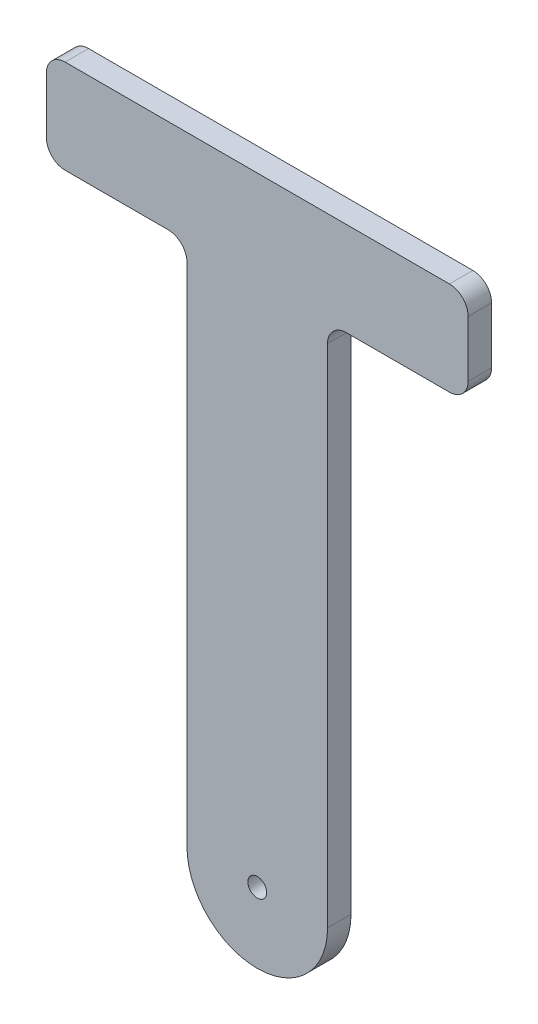
ISO-10303-21;
HEADER;
FILE_DESCRIPTION(('STEP AP214'),'2;1');
FILE_NAME('part.step','',(''),(''),'','','');
FILE_SCHEMA(('AUTOMOTIVE_DESIGN { 1 0 10303 214 1 1 1 1 }'));
ENDSEC;
DATA;
#1=APPLICATION_CONTEXT('core data for automotive mechanical design processes');
#2=APPLICATION_PROTOCOL_DEFINITION('international standard','automotive_design',2000,#1);
#3=PRODUCT_CONTEXT('',#1,'mechanical');
#4=PRODUCT('Part','Part','',(#3));
#5=PRODUCT_RELATED_PRODUCT_CATEGORY('part','',(#4));
#6=PRODUCT_DEFINITION_FORMATION('','',#4);
#7=PRODUCT_DEFINITION_CONTEXT('part definition',#1,'design');
#8=PRODUCT_DEFINITION('design','',#6,#7);
#9=PRODUCT_DEFINITION_SHAPE('','',#8);
#10=(LENGTH_UNIT() NAMED_UNIT(*) SI_UNIT(.MILLI.,.METRE.));
#11=(NAMED_UNIT(*) PLANE_ANGLE_UNIT() SI_UNIT($,.RADIAN.));
#12=(NAMED_UNIT(*) SI_UNIT($,.STERADIAN.) SOLID_ANGLE_UNIT());
#13=UNCERTAINTY_MEASURE_WITH_UNIT(LENGTH_MEASURE(1.E-05),#10,'distance_accuracy_value','');
#14=(GEOMETRIC_REPRESENTATION_CONTEXT(3) GLOBAL_UNCERTAINTY_ASSIGNED_CONTEXT((#13)) GLOBAL_UNIT_ASSIGNED_CONTEXT((#10,
#11,#12)) REPRESENTATION_CONTEXT('',''));
#15=CARTESIAN_POINT('',(0.,0.,0.));
#16=DIRECTION('',(0.,0.,1.));
#17=DIRECTION('',(1.,0.,0.));
#18=AXIS2_PLACEMENT_3D('',#15,#16,#17);
#19=CARTESIAN_POINT('',(-9.82801288749565,0.,3.175));
#20=DIRECTION('',(0.,0.,1.));
#21=DIRECTION('',(1.,0.,0.));
#22=AXIS2_PLACEMENT_3D('',#19,#20,#21);
#23=PLANE('',#22);
#24=CARTESIAN_POINT('',(-9.82801288749565,0.,3.175));
#25=DIRECTION('',(0.,0.,1.));
#26=DIRECTION('',(1.,0.,0.));
#27=AXIS2_PLACEMENT_3D('',#24,#25,#26);
#28=CIRCLE('',#27,9.525);
#29=CARTESIAN_POINT('',(-19.3530128874956,0.,3.175));
#30=VERTEX_POINT('',#29);
#31=CARTESIAN_POINT('',(-0.30301288749565,0.,3.175));
#32=VERTEX_POINT('',#31);
#33=EDGE_CURVE('E193',#30,#32,#28,.T.);
#34=ORIENTED_EDGE('',*,*,#33,.T.);
#35=DIRECTION('',(0.,1.,0.));
#36=VECTOR('',#35,1.);
#37=CARTESIAN_POINT('',(-0.303012887495659,68.58,3.175));
#38=LINE('',#37,#36);
#39=CARTESIAN_POINT('',(-0.30301288749566,68.58,3.175));
#40=VERTEX_POINT('',#39);
#41=EDGE_CURVE('E111',#32,#40,#38,.T.);
#42=ORIENTED_EDGE('',*,*,#41,.T.);
#43=CARTESIAN_POINT('',(2.23698711250434,68.58,3.175));
#44=DIRECTION('',(0.,0.,-1.));
#45=DIRECTION('',(1.,0.,0.));
#46=AXIS2_PLACEMENT_3D('',#43,#44,#45);
#47=CIRCLE('',#46,2.54);
#48=CARTESIAN_POINT('',(2.23698711250436,71.12,3.175));
#49=VERTEX_POINT('',#48);
#50=EDGE_CURVE('E226',#40,#49,#47,.T.);
#51=ORIENTED_EDGE('',*,*,#50,.T.);
#52=DIRECTION('',(1.,0.,0.));
#53=VECTOR('',#52,1.);
#54=CARTESIAN_POINT('',(2.23698711250436,71.12,3.175));
#55=LINE('',#54,#53);
#56=CARTESIAN_POINT('',(16.2069871125043,71.12,3.175));
#57=VERTEX_POINT('',#56);
#58=EDGE_CURVE('E245',#49,#57,#55,.T.);
#59=ORIENTED_EDGE('',*,*,#58,.T.);
#60=CARTESIAN_POINT('',(16.2069871125043,73.66,3.175));
#61=DIRECTION('',(0.,0.,1.));
#62=DIRECTION('',(1.,0.,0.));
#63=AXIS2_PLACEMENT_3D('',#60,#61,#62);
#64=CIRCLE('',#63,2.54);
#65=CARTESIAN_POINT('',(18.7469871125043,73.66,3.175));
#66=VERTEX_POINT('',#65);
#67=EDGE_CURVE('E242',#57,#66,#64,.T.);
#68=ORIENTED_EDGE('',*,*,#67,.T.);
#69=DIRECTION('',(0.,1.,0.));
#70=VECTOR('',#69,1.);
#71=CARTESIAN_POINT('',(18.7469871125043,73.66,3.175));
#72=LINE('',#71,#70);
#73=CARTESIAN_POINT('',(18.7469871125043,81.28,3.175));
#74=VERTEX_POINT('',#73);
#75=EDGE_CURVE('E244',#66,#74,#72,.T.);
#76=ORIENTED_EDGE('',*,*,#75,.T.);
#77=CARTESIAN_POINT('',(16.2069871125043,81.28,3.175));
#78=DIRECTION('',(0.,0.,1.));
#79=DIRECTION('',(1.,0.,0.));
#80=AXIS2_PLACEMENT_3D('',#77,#78,#79);
#81=CIRCLE('',#80,2.54);
#82=CARTESIAN_POINT('',(16.2069871125043,83.82,3.175));
#83=VERTEX_POINT('',#82);
#84=EDGE_CURVE('E247',#74,#83,#81,.T.);
#85=ORIENTED_EDGE('',*,*,#84,.T.);
#86=DIRECTION('',(-1.,0.,0.));
#87=VECTOR('',#86,1.);
#88=CARTESIAN_POINT('',(16.2069871125043,83.82,3.175));
#89=LINE('',#88,#87);
#90=CARTESIAN_POINT('',(-35.8630128874956,83.82,3.175));
#91=VERTEX_POINT('',#90);
#92=EDGE_CURVE('E253',#83,#91,#89,.T.);
#93=ORIENTED_EDGE('',*,*,#92,.T.);
#94=CARTESIAN_POINT('',(-35.8630128874956,81.28,3.175));
#95=DIRECTION('',(0.,0.,1.));
#96=DIRECTION('',(-1.,0.,0.));
#97=AXIS2_PLACEMENT_3D('',#94,#95,#96);
#98=CIRCLE('',#97,2.54);
#99=CARTESIAN_POINT('',(-38.4030128874957,81.28,3.175));
#100=VERTEX_POINT('',#99);
#101=EDGE_CURVE('E255',#91,#100,#98,.T.);
#102=ORIENTED_EDGE('',*,*,#101,.T.);
#103=DIRECTION('',(0.,-1.,0.));
#104=VECTOR('',#103,1.);
#105=CARTESIAN_POINT('',(-38.4030128874957,73.66,3.175));
#106=LINE('',#105,#104);
#107=CARTESIAN_POINT('',(-38.4030128874957,73.66,3.175));
#108=VERTEX_POINT('',#107);
#109=EDGE_CURVE('E257',#100,#108,#106,.T.);
#110=ORIENTED_EDGE('',*,*,#109,.T.);
#111=CARTESIAN_POINT('',(-35.8630128874957,73.66,3.175));
#112=DIRECTION('',(0.,0.,1.));
#113=DIRECTION('',(-1.,0.,0.));
#114=AXIS2_PLACEMENT_3D('',#111,#112,#113);
#115=CIRCLE('',#114,2.54);
#116=CARTESIAN_POINT('',(-35.8630128874956,71.12,3.175));
#117=VERTEX_POINT('',#116);
#118=EDGE_CURVE('E148',#108,#117,#115,.T.);
#119=ORIENTED_EDGE('',*,*,#118,.T.);
#120=DIRECTION('',(1.,0.,0.));
#121=VECTOR('',#120,1.);
#122=CARTESIAN_POINT('',(-21.8930128874957,71.12,3.175));
#123=LINE('',#122,#121);
#124=CARTESIAN_POINT('',(-21.8930128874957,71.12,3.175));
#125=VERTEX_POINT('',#124);
#126=EDGE_CURVE('E142',#117,#125,#123,.T.);
#127=ORIENTED_EDGE('',*,*,#126,.T.);
#128=CARTESIAN_POINT('',(-21.8930128874957,68.58,3.175));
#129=DIRECTION('',(0.,0.,-1.));
#130=DIRECTION('',(1.,0.,0.));
#131=AXIS2_PLACEMENT_3D('',#128,#129,#130);
#132=CIRCLE('',#131,2.54);
#133=CARTESIAN_POINT('',(-19.3530128874957,68.58,3.175));
#134=VERTEX_POINT('',#133);
#135=EDGE_CURVE('E146',#125,#134,#132,.T.);
#136=ORIENTED_EDGE('',*,*,#135,.T.);
#137=DIRECTION('',(0.,-1.,0.));
#138=VECTOR('',#137,1.);
#139=CARTESIAN_POINT('',(-19.3530128874956,0.,3.175));
#140=LINE('',#139,#138);
#141=EDGE_CURVE('E50',#134,#30,#140,.T.);
#142=ORIENTED_EDGE('',*,*,#141,.T.);
#143=EDGE_LOOP('',(#34,#42,#51,#59,#68,#76,#85,#93,#102,#110,#119,#127,#136,#142));
#144=FACE_BOUND('',#143,.T.);
#145=CARTESIAN_POINT('',(-9.82801288749565,0.,3.175));
#146=DIRECTION('',(0.,0.,1.));
#147=DIRECTION('',(1.,0.,0.));
#148=AXIS2_PLACEMENT_3D('',#145,#146,#147);
#149=CIRCLE('',#148,1.27);
#150=CARTESIAN_POINT('',(-8.55801288749565,0.,3.175));
#151=VERTEX_POINT('',#150);
#152=EDGE_CURVE('E170',#151,#151,#149,.T.);
#153=ORIENTED_EDGE('',*,*,#152,.F.);
#154=EDGE_LOOP('',(#153));
#155=FACE_BOUND('',#154,.T.);
#156=ADVANCED_FACE('F33',(#144,#155),#23,.T.);
#157=CARTESIAN_POINT('',(-9.82801288749565,0.,0.));
#158=DIRECTION('',(0.,0.,1.));
#159=DIRECTION('',(1.,0.,0.));
#160=AXIS2_PLACEMENT_3D('',#157,#158,#159);
#161=PLANE('',#160);
#162=CARTESIAN_POINT('',(-9.82801288749565,0.,0.));
#163=DIRECTION('',(0.,0.,1.));
#164=DIRECTION('',(1.,0.,0.));
#165=AXIS2_PLACEMENT_3D('',#162,#163,#164);
#166=CIRCLE('',#165,9.525);
#167=CARTESIAN_POINT('',(-19.3530128874956,0.,0.));
#168=VERTEX_POINT('',#167);
#169=CARTESIAN_POINT('',(-0.30301288749565,0.,0.));
#170=VERTEX_POINT('',#169);
#171=EDGE_CURVE('E166',#168,#170,#166,.T.);
#172=ORIENTED_EDGE('',*,*,#171,.F.);
#173=DIRECTION('',(0.,-1.,0.));
#174=VECTOR('',#173,1.);
#175=CARTESIAN_POINT('',(-19.3530128874956,0.,0.));
#176=LINE('',#175,#174);
#177=CARTESIAN_POINT('',(-19.3530128874957,68.58,0.));
#178=VERTEX_POINT('',#177);
#179=EDGE_CURVE('E103',#178,#168,#176,.T.);
#180=ORIENTED_EDGE('',*,*,#179,.F.);
#181=CARTESIAN_POINT('',(-21.8930128874957,68.58,0.));
#182=DIRECTION('',(0.,0.,-1.));
#183=DIRECTION('',(1.,0.,0.));
#184=AXIS2_PLACEMENT_3D('',#181,#182,#183);
#185=CIRCLE('',#184,2.54);
#186=CARTESIAN_POINT('',(-21.8930128874957,71.12,0.));
#187=VERTEX_POINT('',#186);
#188=EDGE_CURVE('E97',#187,#178,#185,.T.);
#189=ORIENTED_EDGE('',*,*,#188,.F.);
#190=DIRECTION('',(1.,0.,0.));
#191=VECTOR('',#190,1.);
#192=CARTESIAN_POINT('',(-21.8930128874957,71.12,0.));
#193=LINE('',#192,#191);
#194=CARTESIAN_POINT('',(-35.8630128874956,71.12,0.));
#195=VERTEX_POINT('',#194);
#196=EDGE_CURVE('E156',#195,#187,#193,.T.);
#197=ORIENTED_EDGE('',*,*,#196,.F.);
#198=CARTESIAN_POINT('',(-35.8630128874957,73.66,0.));
#199=DIRECTION('',(0.,0.,1.));
#200=DIRECTION('',(-1.,0.,0.));
#201=AXIS2_PLACEMENT_3D('',#198,#199,#200);
#202=CIRCLE('',#201,2.54);
#203=CARTESIAN_POINT('',(-38.4030128874957,73.66,0.));
#204=VERTEX_POINT('',#203);
#205=EDGE_CURVE('E188',#204,#195,#202,.T.);
#206=ORIENTED_EDGE('',*,*,#205,.F.);
#207=DIRECTION('',(0.,-1.,0.));
#208=VECTOR('',#207,1.);
#209=CARTESIAN_POINT('',(-38.4030128874957,73.66,0.));
#210=LINE('',#209,#208);
#211=CARTESIAN_POINT('',(-38.4030128874957,81.28,0.));
#212=VERTEX_POINT('',#211);
#213=EDGE_CURVE('E186',#212,#204,#210,.T.);
#214=ORIENTED_EDGE('',*,*,#213,.F.);
#215=CARTESIAN_POINT('',(-35.8630128874956,81.28,0.));
#216=DIRECTION('',(0.,0.,1.));
#217=DIRECTION('',(-1.,0.,0.));
#218=AXIS2_PLACEMENT_3D('',#215,#216,#217);
#219=CIRCLE('',#218,2.54);
#220=CARTESIAN_POINT('',(-35.8630128874956,83.82,0.));
#221=VERTEX_POINT('',#220);
#222=EDGE_CURVE('E184',#221,#212,#219,.T.);
#223=ORIENTED_EDGE('',*,*,#222,.F.);
#224=DIRECTION('',(-1.,0.,0.));
#225=VECTOR('',#224,1.);
#226=CARTESIAN_POINT('',(16.2069871125043,83.82,0.));
#227=LINE('',#226,#225);
#228=CARTESIAN_POINT('',(16.2069871125043,83.82,0.));
#229=VERTEX_POINT('',#228);
#230=EDGE_CURVE('E182',#229,#221,#227,.T.);
#231=ORIENTED_EDGE('',*,*,#230,.F.);
#232=CARTESIAN_POINT('',(16.2069871125043,81.28,0.));
#233=DIRECTION('',(0.,0.,1.));
#234=DIRECTION('',(1.,0.,0.));
#235=AXIS2_PLACEMENT_3D('',#232,#233,#234);
#236=CIRCLE('',#235,2.54);
#237=CARTESIAN_POINT('',(18.7469871125043,81.28,0.));
#238=VERTEX_POINT('',#237);
#239=EDGE_CURVE('E180',#238,#229,#236,.T.);
#240=ORIENTED_EDGE('',*,*,#239,.F.);
#241=DIRECTION('',(0.,1.,0.));
#242=VECTOR('',#241,1.);
#243=CARTESIAN_POINT('',(18.7469871125043,73.66,0.));
#244=LINE('',#243,#242);
#245=CARTESIAN_POINT('',(18.7469871125043,73.66,0.));
#246=VERTEX_POINT('',#245);
#247=EDGE_CURVE('E178',#246,#238,#244,.T.);
#248=ORIENTED_EDGE('',*,*,#247,.F.);
#249=CARTESIAN_POINT('',(16.2069871125043,73.66,0.));
#250=DIRECTION('',(0.,0.,1.));
#251=DIRECTION('',(1.,0.,0.));
#252=AXIS2_PLACEMENT_3D('',#249,#250,#251);
#253=CIRCLE('',#252,2.54);
#254=CARTESIAN_POINT('',(16.2069871125043,71.12,0.));
#255=VERTEX_POINT('',#254);
#256=EDGE_CURVE('E176',#255,#246,#253,.T.);
#257=ORIENTED_EDGE('',*,*,#256,.F.);
#258=DIRECTION('',(1.,0.,0.));
#259=VECTOR('',#258,1.);
#260=CARTESIAN_POINT('',(2.23698711250436,71.12,0.));
#261=LINE('',#260,#259);
#262=CARTESIAN_POINT('',(2.23698711250436,71.12,0.));
#263=VERTEX_POINT('',#262);
#264=EDGE_CURVE('E174',#263,#255,#261,.T.);
#265=ORIENTED_EDGE('',*,*,#264,.F.);
#266=CARTESIAN_POINT('',(2.23698711250434,68.58,0.));
#267=DIRECTION('',(0.,0.,-1.));
#268=DIRECTION('',(1.,0.,0.));
#269=AXIS2_PLACEMENT_3D('',#266,#267,#268);
#270=CIRCLE('',#269,2.54);
#271=CARTESIAN_POINT('',(-0.30301288749566,68.58,0.));
#272=VERTEX_POINT('',#271);
#273=EDGE_CURVE('E172',#272,#263,#270,.T.);
#274=ORIENTED_EDGE('',*,*,#273,.F.);
#275=DIRECTION('',(0.,1.,0.));
#276=VECTOR('',#275,1.);
#277=CARTESIAN_POINT('',(-0.303012887495659,68.58,0.));
#278=LINE('',#277,#276);
#279=EDGE_CURVE('E169',#170,#272,#278,.T.);
#280=ORIENTED_EDGE('',*,*,#279,.F.);
#281=EDGE_LOOP('',(#172,#180,#189,#197,#206,#214,#223,#231,#240,#248,#257,#265,#274,#280));
#282=FACE_BOUND('',#281,.T.);
#283=CARTESIAN_POINT('',(-9.82801288749565,0.,0.));
#284=DIRECTION('',(0.,0.,1.));
#285=DIRECTION('',(1.,0.,0.));
#286=AXIS2_PLACEMENT_3D('',#283,#284,#285);
#287=CIRCLE('',#286,1.27);
#288=CARTESIAN_POINT('',(-8.55801288749565,0.,0.));
#289=VERTEX_POINT('',#288);
#290=EDGE_CURVE('E430',#289,#289,#287,.T.);
#291=ORIENTED_EDGE('',*,*,#290,.T.);
#292=EDGE_LOOP('',(#291));
#293=FACE_BOUND('',#292,.T.);
#294=ADVANCED_FACE('F230',(#282,#293),#161,.F.);
#295=CARTESIAN_POINT('',(-9.82801288749565,0.,3.175));
#296=DIRECTION('',(0.,0.,-1.));
#297=DIRECTION('',(-1.,0.,0.));
#298=AXIS2_PLACEMENT_3D('',#295,#296,#297);
#299=CYLINDRICAL_SURFACE('',#298,9.525);
#300=ORIENTED_EDGE('',*,*,#171,.T.);
#301=DIRECTION('',(0.,0.,-1.));
#302=VECTOR('',#301,1.);
#303=CARTESIAN_POINT('',(-0.30301288749565,0.,3.175));
#304=LINE('',#303,#302);
#305=EDGE_CURVE('E11',#32,#170,#304,.T.);
#306=ORIENTED_EDGE('',*,*,#305,.F.);
#307=ORIENTED_EDGE('',*,*,#33,.F.);
#308=DIRECTION('',(0.,0.,-1.));
#309=VECTOR('',#308,1.);
#310=CARTESIAN_POINT('',(-19.3530128874956,0.,3.175));
#311=LINE('',#310,#309);
#312=EDGE_CURVE('E162',#30,#168,#311,.T.);
#313=ORIENTED_EDGE('',*,*,#312,.T.);
#314=EDGE_LOOP('',(#300,#306,#307,#313));
#315=FACE_BOUND('',#314,.T.);
#316=ADVANCED_FACE('F35',(#315),#299,.T.);
#317=CARTESIAN_POINT('',(-0.303012887495659,68.58,3.175));
#318=DIRECTION('',(-1.,0.,0.));
#319=DIRECTION('',(0.,-1.,0.));
#320=AXIS2_PLACEMENT_3D('',#317,#318,#319);
#321=PLANE('',#320);
#322=ORIENTED_EDGE('',*,*,#279,.T.);
#323=DIRECTION('',(0.,0.,-1.));
#324=VECTOR('',#323,1.);
#325=CARTESIAN_POINT('',(-0.30301288749566,68.58,3.175));
#326=LINE('',#325,#324);
#327=EDGE_CURVE('E42',#40,#272,#326,.T.);
#328=ORIENTED_EDGE('',*,*,#327,.F.);
#329=ORIENTED_EDGE('',*,*,#41,.F.);
#330=ORIENTED_EDGE('',*,*,#305,.T.);
#331=EDGE_LOOP('',(#322,#328,#329,#330));
#332=FACE_BOUND('',#331,.T.);
#333=ADVANCED_FACE('F291',(#332),#321,.F.);
#334=CARTESIAN_POINT('',(2.23698711250434,68.58,3.175));
#335=DIRECTION('',(0.,0.,-1.));
#336=DIRECTION('',(-1.,0.,0.));
#337=AXIS2_PLACEMENT_3D('',#334,#335,#336);
#338=CYLINDRICAL_SURFACE('',#337,2.54);
#339=ORIENTED_EDGE('',*,*,#273,.T.);
#340=DIRECTION('',(0.,0.,-1.));
#341=VECTOR('',#340,1.);
#342=CARTESIAN_POINT('',(2.23698711250436,71.12,3.175));
#343=LINE('',#342,#341);
#344=EDGE_CURVE('E218',#49,#263,#343,.T.);
#345=ORIENTED_EDGE('',*,*,#344,.F.);
#346=ORIENTED_EDGE('',*,*,#50,.F.);
#347=ORIENTED_EDGE('',*,*,#327,.T.);
#348=EDGE_LOOP('',(#339,#345,#346,#347));
#349=FACE_BOUND('',#348,.T.);
#350=ADVANCED_FACE('F224',(#349),#338,.F.);
#351=CARTESIAN_POINT('',(2.23698711250436,71.12,3.175));
#352=DIRECTION('',(0.,1.,0.));
#353=DIRECTION('',(0.,0.,1.));
#354=AXIS2_PLACEMENT_3D('',#351,#352,#353);
#355=PLANE('',#354);
#356=ORIENTED_EDGE('',*,*,#264,.T.);
#357=DIRECTION('',(0.,0.,-1.));
#358=VECTOR('',#357,1.);
#359=CARTESIAN_POINT('',(16.2069871125043,71.12,3.175));
#360=LINE('',#359,#358);
#361=EDGE_CURVE('E215',#57,#255,#360,.T.);
#362=ORIENTED_EDGE('',*,*,#361,.F.);
#363=ORIENTED_EDGE('',*,*,#58,.F.);
#364=ORIENTED_EDGE('',*,*,#344,.T.);
#365=EDGE_LOOP('',(#356,#362,#363,#364));
#366=FACE_BOUND('',#365,.T.);
#367=ADVANCED_FACE('F236',(#366),#355,.F.);
#368=CARTESIAN_POINT('',(16.2069871125043,73.66,3.175));
#369=DIRECTION('',(0.,0.,-1.));
#370=DIRECTION('',(-1.,0.,0.));
#371=AXIS2_PLACEMENT_3D('',#368,#369,#370);
#372=CYLINDRICAL_SURFACE('',#371,2.54);
#373=ORIENTED_EDGE('',*,*,#256,.T.);
#374=DIRECTION('',(0.,0.,-1.));
#375=VECTOR('',#374,1.);
#376=CARTESIAN_POINT('',(18.7469871125043,73.66,3.175));
#377=LINE('',#376,#375);
#378=EDGE_CURVE('E212',#66,#246,#377,.T.);
#379=ORIENTED_EDGE('',*,*,#378,.F.);
#380=ORIENTED_EDGE('',*,*,#67,.F.);
#381=ORIENTED_EDGE('',*,*,#361,.T.);
#382=EDGE_LOOP('',(#373,#379,#380,#381));
#383=FACE_BOUND('',#382,.T.);
#384=ADVANCED_FACE('F240',(#383),#372,.T.);
#385=CARTESIAN_POINT('',(18.7469871125043,73.66,3.175));
#386=DIRECTION('',(-1.,0.,0.));
#387=DIRECTION('',(0.,0.,1.));
#388=AXIS2_PLACEMENT_3D('',#385,#386,#387);
#389=PLANE('',#388);
#390=ORIENTED_EDGE('',*,*,#247,.T.);
#391=DIRECTION('',(0.,0.,-1.));
#392=VECTOR('',#391,1.);
#393=CARTESIAN_POINT('',(18.7469871125043,81.28,3.175));
#394=LINE('',#393,#392);
#395=EDGE_CURVE('E209',#74,#238,#394,.T.);
#396=ORIENTED_EDGE('',*,*,#395,.F.);
#397=ORIENTED_EDGE('',*,*,#75,.F.);
#398=ORIENTED_EDGE('',*,*,#378,.T.);
#399=EDGE_LOOP('',(#390,#396,#397,#398));
#400=FACE_BOUND('',#399,.T.);
#401=ADVANCED_FACE('F304',(#400),#389,.F.);
#402=CARTESIAN_POINT('',(16.2069871125043,81.28,3.175));
#403=DIRECTION('',(0.,0.,-1.));
#404=DIRECTION('',(-1.,0.,0.));
#405=AXIS2_PLACEMENT_3D('',#402,#403,#404);
#406=CYLINDRICAL_SURFACE('',#405,2.54);
#407=ORIENTED_EDGE('',*,*,#239,.T.);
#408=DIRECTION('',(0.,0.,-1.));
#409=VECTOR('',#408,1.);
#410=CARTESIAN_POINT('',(16.2069871125043,83.82,3.175));
#411=LINE('',#410,#409);
#412=EDGE_CURVE('E206',#83,#229,#411,.T.);
#413=ORIENTED_EDGE('',*,*,#412,.F.);
#414=ORIENTED_EDGE('',*,*,#84,.F.);
#415=ORIENTED_EDGE('',*,*,#395,.T.);
#416=EDGE_LOOP('',(#407,#413,#414,#415));
#417=FACE_BOUND('',#416,.T.);
#418=ADVANCED_FACE('F307',(#417),#406,.T.);
#419=CARTESIAN_POINT('',(16.2069871125043,83.82,3.175));
#420=DIRECTION('',(0.,-1.,0.));
#421=DIRECTION('',(0.,0.,-1.));
#422=AXIS2_PLACEMENT_3D('',#419,#420,#421);
#423=PLANE('',#422);
#424=ORIENTED_EDGE('',*,*,#230,.T.);
#425=DIRECTION('',(0.,0.,-1.));
#426=VECTOR('',#425,1.);
#427=CARTESIAN_POINT('',(-35.8630128874956,83.82,3.175));
#428=LINE('',#427,#426);
#429=EDGE_CURVE('E203',#91,#221,#428,.T.);
#430=ORIENTED_EDGE('',*,*,#429,.F.);
#431=ORIENTED_EDGE('',*,*,#92,.F.);
#432=ORIENTED_EDGE('',*,*,#412,.T.);
#433=EDGE_LOOP('',(#424,#430,#431,#432));
#434=FACE_BOUND('',#433,.T.);
#435=ADVANCED_FACE('F311',(#434),#423,.F.);
#436=CARTESIAN_POINT('',(-35.8630128874956,81.28,3.175));
#437=DIRECTION('',(0.,0.,-1.));
#438=DIRECTION('',(-1.,0.,0.));
#439=AXIS2_PLACEMENT_3D('',#436,#437,#438);
#440=CYLINDRICAL_SURFACE('',#439,2.54);
#441=ORIENTED_EDGE('',*,*,#222,.T.);
#442=DIRECTION('',(0.,0.,-1.));
#443=VECTOR('',#442,1.);
#444=CARTESIAN_POINT('',(-38.4030128874957,81.28,3.175));
#445=LINE('',#444,#443);
#446=EDGE_CURVE('E200',#100,#212,#445,.T.);
#447=ORIENTED_EDGE('',*,*,#446,.F.);
#448=ORIENTED_EDGE('',*,*,#101,.F.);
#449=ORIENTED_EDGE('',*,*,#429,.T.);
#450=EDGE_LOOP('',(#441,#447,#448,#449));
#451=FACE_BOUND('',#450,.T.);
#452=ADVANCED_FACE('F315',(#451),#440,.T.);
#453=CARTESIAN_POINT('',(-38.4030128874957,73.66,3.175));
#454=DIRECTION('',(1.,0.,0.));
#455=DIRECTION('',(0.,1.,0.));
#456=AXIS2_PLACEMENT_3D('',#453,#454,#455);
#457=PLANE('',#456);
#458=ORIENTED_EDGE('',*,*,#213,.T.);
#459=DIRECTION('',(0.,0.,-1.));
#460=VECTOR('',#459,1.);
#461=CARTESIAN_POINT('',(-38.4030128874957,73.66,3.175));
#462=LINE('',#461,#460);
#463=EDGE_CURVE('E197',#108,#204,#462,.T.);
#464=ORIENTED_EDGE('',*,*,#463,.F.);
#465=ORIENTED_EDGE('',*,*,#109,.F.);
#466=ORIENTED_EDGE('',*,*,#446,.T.);
#467=EDGE_LOOP('',(#458,#464,#465,#466));
#468=FACE_BOUND('',#467,.T.);
#469=ADVANCED_FACE('F263',(#468),#457,.F.);
#470=CARTESIAN_POINT('',(-35.8630128874957,73.66,3.175));
#471=DIRECTION('',(0.,0.,-1.));
#472=DIRECTION('',(-1.,0.,0.));
#473=AXIS2_PLACEMENT_3D('',#470,#471,#472);
#474=CYLINDRICAL_SURFACE('',#473,2.54);
#475=ORIENTED_EDGE('',*,*,#205,.T.);
#476=DIRECTION('',(0.,0.,-1.));
#477=VECTOR('',#476,1.);
#478=CARTESIAN_POINT('',(-35.8630128874956,71.12,3.175));
#479=LINE('',#478,#477);
#480=EDGE_CURVE('E157',#117,#195,#479,.T.);
#481=ORIENTED_EDGE('',*,*,#480,.F.);
#482=ORIENTED_EDGE('',*,*,#118,.F.);
#483=ORIENTED_EDGE('',*,*,#463,.T.);
#484=EDGE_LOOP('',(#475,#481,#482,#483));
#485=FACE_BOUND('',#484,.T.);
#486=ADVANCED_FACE('F267',(#485),#474,.T.);
#487=CARTESIAN_POINT('',(-21.8930128874957,71.12,3.175));
#488=DIRECTION('',(0.,1.,0.));
#489=DIRECTION('',(0.,0.,1.));
#490=AXIS2_PLACEMENT_3D('',#487,#488,#489);
#491=PLANE('',#490);
#492=ORIENTED_EDGE('',*,*,#196,.T.);
#493=DIRECTION('',(0.,0.,-1.));
#494=VECTOR('',#493,1.);
#495=CARTESIAN_POINT('',(-21.8930128874957,71.12,3.175));
#496=LINE('',#495,#494);
#497=EDGE_CURVE('E153',#125,#187,#496,.T.);
#498=ORIENTED_EDGE('',*,*,#497,.F.);
#499=ORIENTED_EDGE('',*,*,#126,.F.);
#500=ORIENTED_EDGE('',*,*,#480,.T.);
#501=EDGE_LOOP('',(#492,#498,#499,#500));
#502=FACE_BOUND('',#501,.T.);
#503=ADVANCED_FACE('F154',(#502),#491,.F.);
#504=CARTESIAN_POINT('',(-21.8930128874957,68.58,3.175));
#505=DIRECTION('',(0.,0.,-1.));
#506=DIRECTION('',(-1.,0.,0.));
#507=AXIS2_PLACEMENT_3D('',#504,#505,#506);
#508=CYLINDRICAL_SURFACE('',#507,2.54);
#509=ORIENTED_EDGE('',*,*,#188,.T.);
#510=DIRECTION('',(0.,0.,-1.));
#511=VECTOR('',#510,1.);
#512=CARTESIAN_POINT('',(-19.3530128874957,68.58,3.175));
#513=LINE('',#512,#511);
#514=EDGE_CURVE('E158',#134,#178,#513,.T.);
#515=ORIENTED_EDGE('',*,*,#514,.F.);
#516=ORIENTED_EDGE('',*,*,#135,.F.);
#517=ORIENTED_EDGE('',*,*,#497,.T.);
#518=EDGE_LOOP('',(#509,#515,#516,#517));
#519=FACE_BOUND('',#518,.T.);
#520=ADVANCED_FACE('F160',(#519),#508,.F.);
#521=CARTESIAN_POINT('',(-19.3530128874956,0.,3.175));
#522=DIRECTION('',(1.,0.,0.));
#523=DIRECTION('',(0.,1.,0.));
#524=AXIS2_PLACEMENT_3D('',#521,#522,#523);
#525=PLANE('',#524);
#526=ORIENTED_EDGE('',*,*,#179,.T.);
#527=ORIENTED_EDGE('',*,*,#312,.F.);
#528=ORIENTED_EDGE('',*,*,#141,.F.);
#529=ORIENTED_EDGE('',*,*,#514,.T.);
#530=EDGE_LOOP('',(#526,#527,#528,#529));
#531=FACE_BOUND('',#530,.T.);
#532=ADVANCED_FACE('F271',(#531),#525,.F.);
#533=CARTESIAN_POINT('',(-9.82801288749565,0.,3.175));
#534=DIRECTION('',(0.,0.,-1.));
#535=DIRECTION('',(-1.,0.,0.));
#536=AXIS2_PLACEMENT_3D('',#533,#534,#535);
#537=CYLINDRICAL_SURFACE('',#536,1.27);
#538=ORIENTED_EDGE('',*,*,#152,.T.);
#539=EDGE_LOOP('',(#538));
#540=FACE_BOUND('',#539,.T.);
#541=ORIENTED_EDGE('',*,*,#290,.F.);
#542=EDGE_LOOP('',(#541));
#543=FACE_BOUND('',#542,.T.);
#544=ADVANCED_FACE('F273',(#540,#543),#537,.F.);
#545=CLOSED_SHELL('',(#156,#294,#316,#333,#350,#367,#384,#401,#418,#435,#452,#469,#486,#503,
#520,#532,#544));
#546=MANIFOLD_SOLID_BREP('B2',#545);
#547=ADVANCED_BREP_SHAPE_REPRESENTATION('',(#18,#546),#14);
#548=SHAPE_DEFINITION_REPRESENTATION(#9,#547);
ENDSEC;
END-ISO-10303-21;
